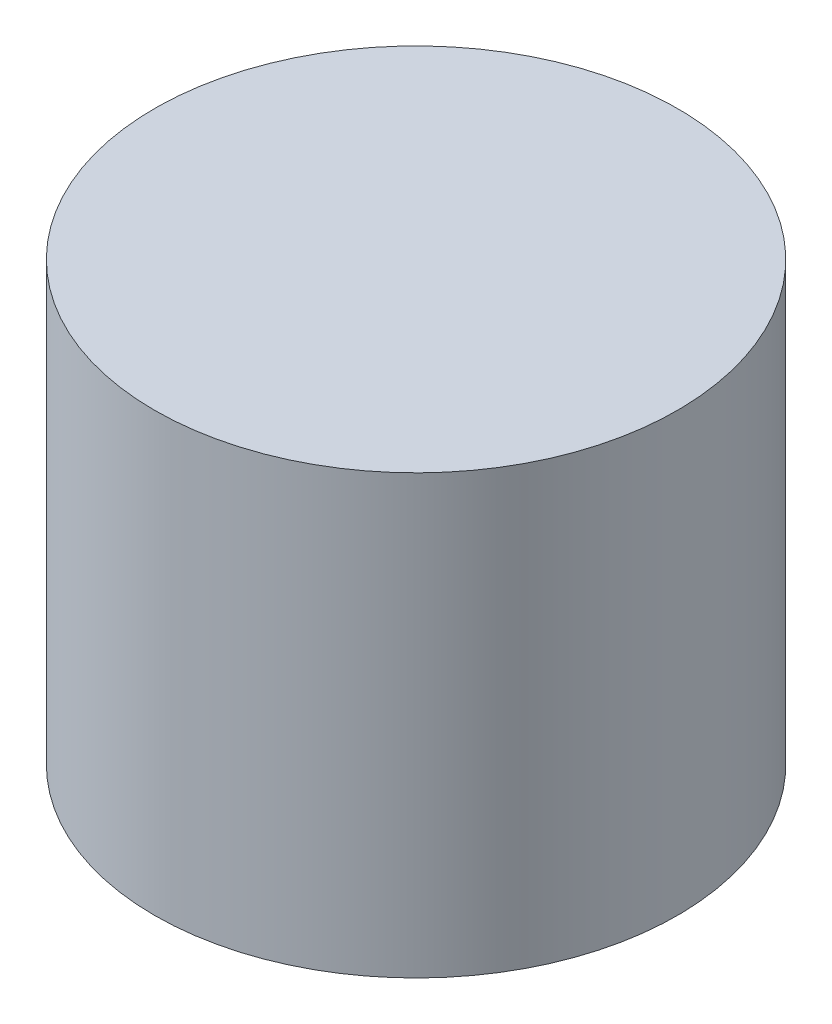
ISO-10303-21;
HEADER;
FILE_DESCRIPTION(('STEP AP214'),'2;1');
FILE_NAME('part.step','',(''),(''),'','','');
FILE_SCHEMA(('AUTOMOTIVE_DESIGN { 1 0 10303 214 1 1 1 1 }'));
ENDSEC;
DATA;
#1=APPLICATION_CONTEXT('core data for automotive mechanical design processes');
#2=APPLICATION_PROTOCOL_DEFINITION('international standard','automotive_design',2000,#1);
#3=PRODUCT_CONTEXT('',#1,'mechanical');
#4=PRODUCT('Part','Part','',(#3));
#5=PRODUCT_RELATED_PRODUCT_CATEGORY('part','',(#4));
#6=PRODUCT_DEFINITION_FORMATION('','',#4);
#7=PRODUCT_DEFINITION_CONTEXT('part definition',#1,'design');
#8=PRODUCT_DEFINITION('design','',#6,#7);
#9=PRODUCT_DEFINITION_SHAPE('','',#8);
#10=(LENGTH_UNIT() NAMED_UNIT(*) SI_UNIT(.MILLI.,.METRE.));
#11=(NAMED_UNIT(*) PLANE_ANGLE_UNIT() SI_UNIT($,.RADIAN.));
#12=(NAMED_UNIT(*) SI_UNIT($,.STERADIAN.) SOLID_ANGLE_UNIT());
#13=UNCERTAINTY_MEASURE_WITH_UNIT(LENGTH_MEASURE(1.E-05),#10,'distance_accuracy_value','');
#14=(GEOMETRIC_REPRESENTATION_CONTEXT(3) GLOBAL_UNCERTAINTY_ASSIGNED_CONTEXT((#13)) GLOBAL_UNIT_ASSIGNED_CONTEXT((#10,
#11,#12)) REPRESENTATION_CONTEXT('',''));
#15=CARTESIAN_POINT('',(0.,0.,0.));
#16=DIRECTION('',(0.,0.,1.));
#17=DIRECTION('',(1.,0.,0.));
#18=AXIS2_PLACEMENT_3D('',#15,#16,#17);
#19=CARTESIAN_POINT('',(0.,2.92,0.));
#20=DIRECTION('',(0.,-1.,0.));
#21=DIRECTION('',(0.,0.,-1.));
#22=AXIS2_PLACEMENT_3D('',#19,#20,#21);
#23=CYLINDRICAL_SURFACE('',#22,3.49);
#24=CARTESIAN_POINT('',(0.,2.92,0.));
#25=DIRECTION('',(0.,1.,0.));
#26=DIRECTION('',(0.,0.,1.));
#27=AXIS2_PLACEMENT_3D('',#24,#25,#26);
#28=CIRCLE('',#27,3.49);
#29=CARTESIAN_POINT('',(0.,2.92,3.49));
#30=VERTEX_POINT('',#29);
#31=EDGE_CURVE('E10',#30,#30,#28,.T.);
#32=ORIENTED_EDGE('',*,*,#31,.F.);
#33=EDGE_LOOP('',(#32));
#34=FACE_BOUND('',#33,.T.);
#35=CARTESIAN_POINT('',(0.,-2.92,0.));
#36=DIRECTION('',(0.,1.,0.));
#37=DIRECTION('',(0.,0.,1.));
#38=AXIS2_PLACEMENT_3D('',#35,#36,#37);
#39=CIRCLE('',#38,3.49);
#40=CARTESIAN_POINT('',(0.,-2.92,3.49));
#41=VERTEX_POINT('',#40);
#42=EDGE_CURVE('E46',#41,#41,#39,.T.);
#43=ORIENTED_EDGE('',*,*,#42,.T.);
#44=EDGE_LOOP('',(#43));
#45=FACE_BOUND('',#44,.T.);
#46=ADVANCED_FACE('F43',(#34,#45),#23,.T.);
#47=CARTESIAN_POINT('',(0.,2.92,0.));
#48=DIRECTION('',(0.,1.,0.));
#49=DIRECTION('',(0.,0.,1.));
#50=AXIS2_PLACEMENT_3D('',#47,#48,#49);
#51=PLANE('',#50);
#52=ORIENTED_EDGE('',*,*,#31,.T.);
#53=EDGE_LOOP('',(#52));
#54=FACE_BOUND('',#53,.T.);
#55=ADVANCED_FACE('F60',(#54),#51,.T.);
#56=CARTESIAN_POINT('',(0.,-2.92,0.));
#57=DIRECTION('',(0.,1.,0.));
#58=DIRECTION('',(0.,0.,1.));
#59=AXIS2_PLACEMENT_3D('',#56,#57,#58);
#60=PLANE('',#59);
#61=ORIENTED_EDGE('',*,*,#42,.F.);
#62=EDGE_LOOP('',(#61));
#63=FACE_BOUND('',#62,.T.);
#64=ADVANCED_FACE('F58',(#63),#60,.F.);
#65=CLOSED_SHELL('',(#46,#55,#64));
#66=MANIFOLD_SOLID_BREP('B2',#65);
#67=ADVANCED_BREP_SHAPE_REPRESENTATION('',(#18,#66),#14);
#68=SHAPE_DEFINITION_REPRESENTATION(#9,#67);
ENDSEC;
END-ISO-10303-21;
